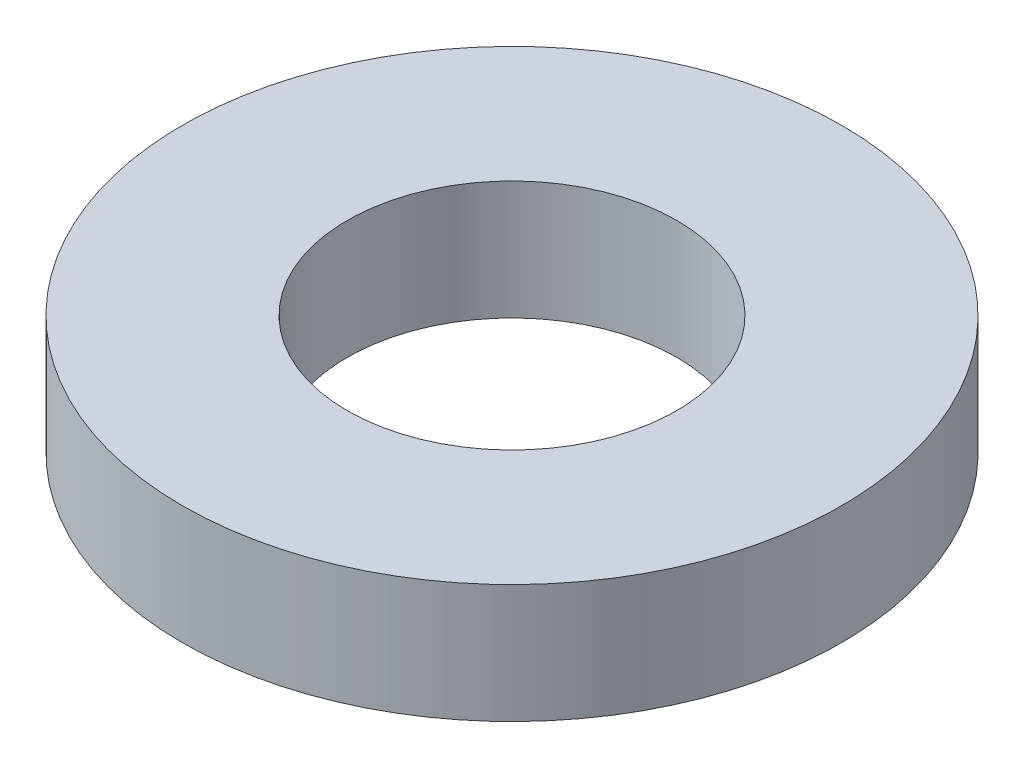
ISO-10303-21;
HEADER;
FILE_DESCRIPTION(('STEP AP214'),'2;1');
FILE_NAME('part.step','',(''),(''),'','','');
FILE_SCHEMA(('AUTOMOTIVE_DESIGN { 1 0 10303 214 1 1 1 1 }'));
ENDSEC;
DATA;
#1=APPLICATION_CONTEXT('core data for automotive mechanical design processes');
#2=APPLICATION_PROTOCOL_DEFINITION('international standard','automotive_design',2000,#1);
#3=PRODUCT_CONTEXT('',#1,'mechanical');
#4=PRODUCT('Part','Part','',(#3));
#5=PRODUCT_RELATED_PRODUCT_CATEGORY('part','',(#4));
#6=PRODUCT_DEFINITION_FORMATION('','',#4);
#7=PRODUCT_DEFINITION_CONTEXT('part definition',#1,'design');
#8=PRODUCT_DEFINITION('design','',#6,#7);
#9=PRODUCT_DEFINITION_SHAPE('','',#8);
#10=(LENGTH_UNIT() NAMED_UNIT(*) SI_UNIT(.MILLI.,.METRE.));
#11=(NAMED_UNIT(*) PLANE_ANGLE_UNIT() SI_UNIT($,.RADIAN.));
#12=(NAMED_UNIT(*) SI_UNIT($,.STERADIAN.) SOLID_ANGLE_UNIT());
#13=UNCERTAINTY_MEASURE_WITH_UNIT(LENGTH_MEASURE(1.E-05),#10,'distance_accuracy_value','');
#14=(GEOMETRIC_REPRESENTATION_CONTEXT(3) GLOBAL_UNCERTAINTY_ASSIGNED_CONTEXT((#13)) GLOBAL_UNIT_ASSIGNED_CONTEXT((#10,
#11,#12)) REPRESENTATION_CONTEXT('',''));
#15=CARTESIAN_POINT('',(0.,0.,0.));
#16=DIRECTION('',(0.,0.,1.));
#17=DIRECTION('',(1.,0.,0.));
#18=AXIS2_PLACEMENT_3D('',#15,#16,#17);
#19=CARTESIAN_POINT('',(0.,27.,0.));
#20=DIRECTION('',(0.,-1.,0.));
#21=DIRECTION('',(0.,0.,-1.));
#22=AXIS2_PLACEMENT_3D('',#19,#20,#21);
#23=CYLINDRICAL_SURFACE('',#22,75.);
#24=CARTESIAN_POINT('',(0.,27.,0.));
#25=DIRECTION('',(0.,1.,0.));
#26=DIRECTION('',(0.,0.,1.));
#27=AXIS2_PLACEMENT_3D('',#24,#25,#26);
#28=CIRCLE('',#27,75.);
#29=CARTESIAN_POINT('',(0.,27.,75.));
#30=VERTEX_POINT('',#29);
#31=EDGE_CURVE('E10',#30,#30,#28,.T.);
#32=ORIENTED_EDGE('',*,*,#31,.F.);
#33=EDGE_LOOP('',(#32));
#34=FACE_BOUND('',#33,.T.);
#35=CARTESIAN_POINT('',(0.,0.,0.));
#36=DIRECTION('',(0.,1.,0.));
#37=DIRECTION('',(0.,0.,1.));
#38=AXIS2_PLACEMENT_3D('',#35,#36,#37);
#39=CIRCLE('',#38,75.);
#40=CARTESIAN_POINT('',(0.,0.,75.));
#41=VERTEX_POINT('',#40);
#42=EDGE_CURVE('E37',#41,#41,#39,.T.);
#43=ORIENTED_EDGE('',*,*,#42,.T.);
#44=EDGE_LOOP('',(#43));
#45=FACE_BOUND('',#44,.T.);
#46=ADVANCED_FACE('F40',(#34,#45),#23,.T.);
#47=CARTESIAN_POINT('',(0.,27.,0.));
#48=DIRECTION('',(0.,1.,0.));
#49=DIRECTION('',(0.,0.,1.));
#50=AXIS2_PLACEMENT_3D('',#47,#48,#49);
#51=PLANE('',#50);
#52=CARTESIAN_POINT('',(0.,27.,0.));
#53=DIRECTION('',(0.,1.,0.));
#54=DIRECTION('',(0.,0.,1.));
#55=AXIS2_PLACEMENT_3D('',#52,#53,#54);
#56=CIRCLE('',#55,37.5);
#57=CARTESIAN_POINT('',(0.,27.,37.5));
#58=VERTEX_POINT('',#57);
#59=EDGE_CURVE('E50',#58,#58,#56,.T.);
#60=ORIENTED_EDGE('',*,*,#59,.F.);
#61=EDGE_LOOP('',(#60));
#62=FACE_BOUND('',#61,.T.);
#63=ORIENTED_EDGE('',*,*,#31,.T.);
#64=EDGE_LOOP('',(#63));
#65=FACE_BOUND('',#64,.T.);
#66=ADVANCED_FACE('F59',(#62,#65),#51,.T.);
#67=CARTESIAN_POINT('',(0.,0.,0.));
#68=DIRECTION('',(0.,1.,0.));
#69=DIRECTION('',(0.,0.,1.));
#70=AXIS2_PLACEMENT_3D('',#67,#68,#69);
#71=PLANE('',#70);
#72=CARTESIAN_POINT('',(0.,0.,0.));
#73=DIRECTION('',(0.,1.,0.));
#74=DIRECTION('',(0.,0.,1.));
#75=AXIS2_PLACEMENT_3D('',#72,#73,#74);
#76=CIRCLE('',#75,37.5);
#77=CARTESIAN_POINT('',(0.,0.,37.5));
#78=VERTEX_POINT('',#77);
#79=EDGE_CURVE('E47',#78,#78,#76,.T.);
#80=ORIENTED_EDGE('',*,*,#79,.T.);
#81=EDGE_LOOP('',(#80));
#82=FACE_BOUND('',#81,.T.);
#83=ORIENTED_EDGE('',*,*,#42,.F.);
#84=EDGE_LOOP('',(#83));
#85=FACE_BOUND('',#84,.T.);
#86=ADVANCED_FACE('F58',(#82,#85),#71,.F.);
#87=CARTESIAN_POINT('',(0.,27.,0.));
#88=DIRECTION('',(0.,-1.,0.));
#89=DIRECTION('',(0.,0.,-1.));
#90=AXIS2_PLACEMENT_3D('',#87,#88,#89);
#91=CYLINDRICAL_SURFACE('',#90,37.5);
#92=ORIENTED_EDGE('',*,*,#59,.T.);
#93=EDGE_LOOP('',(#92));
#94=FACE_BOUND('',#93,.T.);
#95=ORIENTED_EDGE('',*,*,#79,.F.);
#96=EDGE_LOOP('',(#95));
#97=FACE_BOUND('',#96,.T.);
#98=ADVANCED_FACE('F54',(#94,#97),#91,.F.);
#99=CLOSED_SHELL('',(#46,#66,#86,#98));
#100=MANIFOLD_SOLID_BREP('B2',#99);
#101=ADVANCED_BREP_SHAPE_REPRESENTATION('',(#18,#100),#14);
#102=SHAPE_DEFINITION_REPRESENTATION(#9,#101);
ENDSEC;
END-ISO-10303-21;
